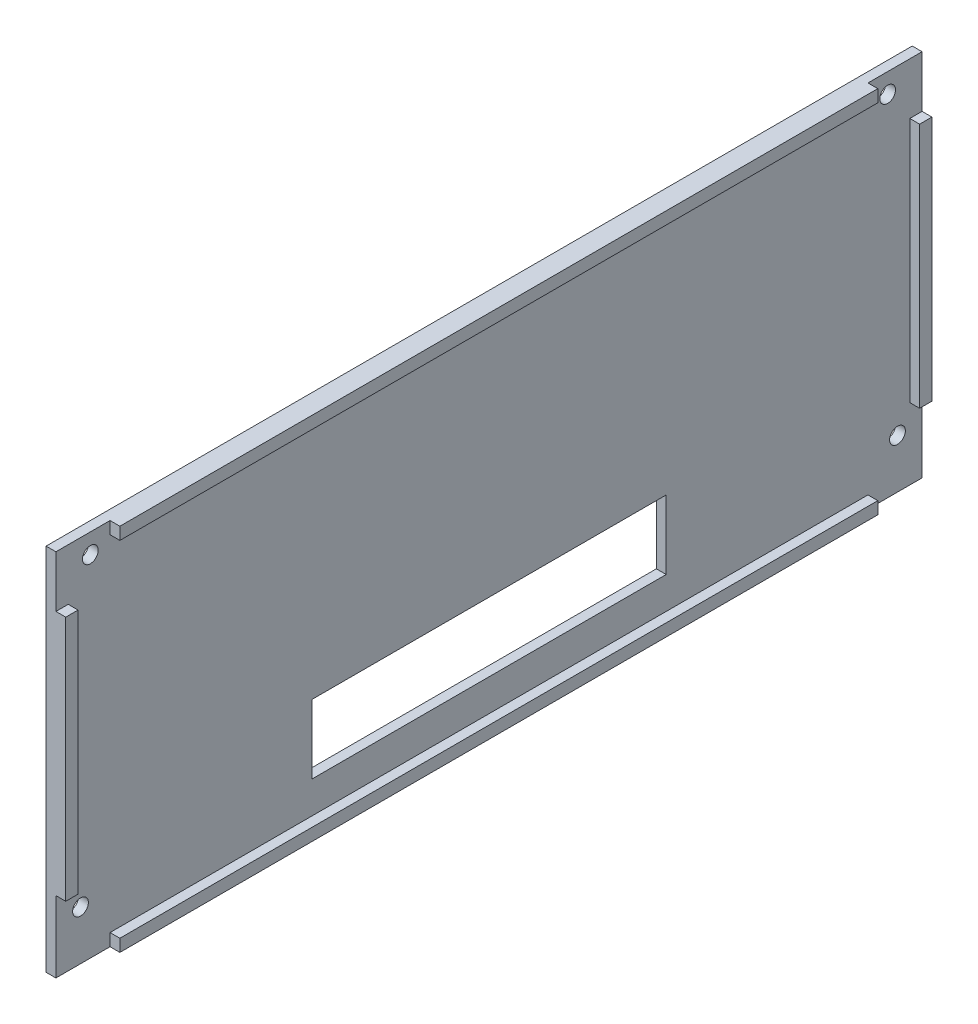
ISO-10303-21;
HEADER;
FILE_DESCRIPTION(('STEP AP214'),'2;1');
FILE_NAME('part.step','',(''),(''),'','','');
FILE_SCHEMA(('AUTOMOTIVE_DESIGN { 1 0 10303 214 1 1 1 1 }'));
ENDSEC;
DATA;
#1=APPLICATION_CONTEXT('core data for automotive mechanical design processes');
#2=APPLICATION_PROTOCOL_DEFINITION('international standard','automotive_design',2000,#1);
#3=PRODUCT_CONTEXT('',#1,'mechanical');
#4=PRODUCT('Part','Part','',(#3));
#5=PRODUCT_RELATED_PRODUCT_CATEGORY('part','',(#4));
#6=PRODUCT_DEFINITION_FORMATION('','',#4);
#7=PRODUCT_DEFINITION_CONTEXT('part definition',#1,'design');
#8=PRODUCT_DEFINITION('design','',#6,#7);
#9=PRODUCT_DEFINITION_SHAPE('','',#8);
#10=(LENGTH_UNIT() NAMED_UNIT(*) SI_UNIT(.MILLI.,.METRE.));
#11=(NAMED_UNIT(*) PLANE_ANGLE_UNIT() SI_UNIT($,.RADIAN.));
#12=(NAMED_UNIT(*) SI_UNIT($,.STERADIAN.) SOLID_ANGLE_UNIT());
#13=UNCERTAINTY_MEASURE_WITH_UNIT(LENGTH_MEASURE(1.E-05),#10,'distance_accuracy_value','');
#14=(GEOMETRIC_REPRESENTATION_CONTEXT(3) GLOBAL_UNCERTAINTY_ASSIGNED_CONTEXT((#13)) GLOBAL_UNIT_ASSIGNED_CONTEXT((#10,
#11,#12)) REPRESENTATION_CONTEXT('',''));
#15=CARTESIAN_POINT('',(0.,0.,0.));
#16=DIRECTION('',(0.,0.,1.));
#17=DIRECTION('',(1.,0.,0.));
#18=AXIS2_PLACEMENT_3D('',#15,#16,#17);
#19=CARTESIAN_POINT('',(2.,0.,0.));
#20=DIRECTION('',(1.,0.,0.));
#21=DIRECTION('',(0.,0.,-1.));
#22=AXIS2_PLACEMENT_3D('',#19,#20,#21);
#23=PLANE('',#22);
#24=DIRECTION('',(0.,-1.,0.));
#25=VECTOR('',#24,1.);
#26=CARTESIAN_POINT('',(2.,-28.5,36.));
#27=LINE('',#26,#25);
#28=CARTESIAN_POINT('',(2.,-14.5,36.));
#29=VERTEX_POINT('',#28);
#30=CARTESIAN_POINT('',(2.,-28.5,36.));
#31=VERTEX_POINT('',#30);
#32=EDGE_CURVE('E311',#29,#31,#27,.T.);
#33=ORIENTED_EDGE('',*,*,#32,.F.);
#34=DIRECTION('',(0.,0.,1.));
#35=VECTOR('',#34,1.);
#36=CARTESIAN_POINT('',(2.,-14.5,36.));
#37=LINE('',#36,#35);
#38=CARTESIAN_POINT('',(2.,-14.5,-36.));
#39=VERTEX_POINT('',#38);
#40=EDGE_CURVE('E316',#39,#29,#37,.T.);
#41=ORIENTED_EDGE('',*,*,#40,.F.);
#42=DIRECTION('',(0.,1.,0.));
#43=VECTOR('',#42,1.);
#44=CARTESIAN_POINT('',(2.,-28.5,-36.));
#45=LINE('',#44,#43);
#46=CARTESIAN_POINT('',(2.,-28.5,-36.));
#47=VERTEX_POINT('',#46);
#48=EDGE_CURVE('E330',#47,#39,#45,.T.);
#49=ORIENTED_EDGE('',*,*,#48,.F.);
#50=DIRECTION('',(0.,0.,-1.));
#51=VECTOR('',#50,1.);
#52=CARTESIAN_POINT('',(2.,-28.5,36.));
#53=LINE('',#52,#51);
#54=EDGE_CURVE('E327',#31,#47,#53,.T.);
#55=ORIENTED_EDGE('',*,*,#54,.F.);
#56=EDGE_LOOP('',(#33,#41,#49,#55));
#57=FACE_BOUND('',#56,.T.);
#58=CARTESIAN_POINT('',(2.,-27.5,83.));
#59=DIRECTION('',(1.,0.,0.));
#60=DIRECTION('',(0.,0.,-1.));
#61=AXIS2_PLACEMENT_3D('',#58,#59,#60);
#62=CIRCLE('',#61,1.6);
#63=CARTESIAN_POINT('',(2.,-27.5,81.4));
#64=VERTEX_POINT('',#63);
#65=EDGE_CURVE('E350',#64,#64,#62,.T.);
#66=ORIENTED_EDGE('',*,*,#65,.F.);
#67=EDGE_LOOP('',(#66));
#68=FACE_BOUND('',#67,.T.);
#69=CARTESIAN_POINT('',(2.,33.5,81.));
#70=DIRECTION('',(1.,0.,0.));
#71=DIRECTION('',(0.,0.,-1.));
#72=AXIS2_PLACEMENT_3D('',#69,#70,#71);
#73=CIRCLE('',#72,1.60000000000001);
#74=CARTESIAN_POINT('',(2.,33.5,79.4));
#75=VERTEX_POINT('',#74);
#76=EDGE_CURVE('E362',#75,#75,#73,.T.);
#77=ORIENTED_EDGE('',*,*,#76,.F.);
#78=EDGE_LOOP('',(#77));
#79=FACE_BOUND('',#78,.T.);
#80=CARTESIAN_POINT('',(2.,33.5,-81.));
#81=DIRECTION('',(1.,0.,0.));
#82=DIRECTION('',(0.,0.,1.));
#83=AXIS2_PLACEMENT_3D('',#80,#81,#82);
#84=CIRCLE('',#83,1.60000000000001);
#85=CARTESIAN_POINT('',(2.,33.5,-79.4));
#86=VERTEX_POINT('',#85);
#87=EDGE_CURVE('E356',#86,#86,#84,.T.);
#88=ORIENTED_EDGE('',*,*,#87,.F.);
#89=EDGE_LOOP('',(#88));
#90=FACE_BOUND('',#89,.T.);
#91=CARTESIAN_POINT('',(2.,-27.5,-82.9999999999999));
#92=DIRECTION('',(1.,0.,0.));
#93=DIRECTION('',(0.,0.,1.));
#94=AXIS2_PLACEMENT_3D('',#91,#92,#93);
#95=CIRCLE('',#94,1.6);
#96=CARTESIAN_POINT('',(2.,-27.5,-81.3999999999999));
#97=VERTEX_POINT('',#96);
#98=EDGE_CURVE('E344',#97,#97,#95,.T.);
#99=ORIENTED_EDGE('',*,*,#98,.F.);
#100=EDGE_LOOP('',(#99));
#101=FACE_BOUND('',#100,.T.);
#102=DIRECTION('',(0.,-1.,0.));
#103=VECTOR('',#102,1.);
#104=CARTESIAN_POINT('',(2.,27.,-85.5));
#105=LINE('',#104,#103);
#106=CARTESIAN_POINT('',(2.,27.,-85.5));
#107=VERTEX_POINT('',#106);
#108=CARTESIAN_POINT('',(2.,-23.,-85.5));
#109=VERTEX_POINT('',#108);
#110=EDGE_CURVE('E48',#107,#109,#105,.T.);
#111=ORIENTED_EDGE('',*,*,#110,.F.);
#112=DIRECTION('',(0.,0.,1.));
#113=VECTOR('',#112,1.);
#114=CARTESIAN_POINT('',(2.,27.,-88.));
#115=LINE('',#114,#113);
#116=CARTESIAN_POINT('',(2.,27.,-88.));
#117=VERTEX_POINT('',#116);
#118=EDGE_CURVE('E416',#117,#107,#115,.T.);
#119=ORIENTED_EDGE('',*,*,#118,.F.);
#120=DIRECTION('',(0.,1.,0.));
#121=VECTOR('',#120,1.);
#122=CARTESIAN_POINT('',(2.,37.5,-88.));
#123=LINE('',#122,#121);
#124=CARTESIAN_POINT('',(2.,37.5,-88.));
#125=VERTEX_POINT('',#124);
#126=EDGE_CURVE('E215',#117,#125,#123,.T.);
#127=ORIENTED_EDGE('',*,*,#126,.T.);
#128=DIRECTION('',(0.,0.,1.));
#129=VECTOR('',#128,1.);
#130=CARTESIAN_POINT('',(2.,37.5,88.));
#131=LINE('',#130,#129);
#132=CARTESIAN_POINT('',(2.,37.5,-77.));
#133=VERTEX_POINT('',#132);
#134=EDGE_CURVE('E371',#125,#133,#131,.T.);
#135=ORIENTED_EDGE('',*,*,#134,.T.);
#136=DIRECTION('',(0.,1.,0.));
#137=VECTOR('',#136,1.);
#138=CARTESIAN_POINT('',(2.,37.5,-77.));
#139=LINE('',#138,#137);
#140=CARTESIAN_POINT('',(2.,34.9999999999999,-77.));
#141=VERTEX_POINT('',#140);
#142=EDGE_CURVE('E256',#141,#133,#139,.T.);
#143=ORIENTED_EDGE('',*,*,#142,.F.);
#144=DIRECTION('',(0.,0.,-1.));
#145=VECTOR('',#144,1.);
#146=CARTESIAN_POINT('',(2.,35.,77.));
#147=LINE('',#146,#145);
#148=CARTESIAN_POINT('',(2.,35.,77.));
#149=VERTEX_POINT('',#148);
#150=EDGE_CURVE('E265',#149,#141,#147,.T.);
#151=ORIENTED_EDGE('',*,*,#150,.F.);
#152=DIRECTION('',(0.,-1.,0.));
#153=VECTOR('',#152,1.);
#154=CARTESIAN_POINT('',(2.,37.5,77.));
#155=LINE('',#154,#153);
#156=CARTESIAN_POINT('',(2.,37.5,77.));
#157=VERTEX_POINT('',#156);
#158=EDGE_CURVE('E251',#157,#149,#155,.T.);
#159=ORIENTED_EDGE('',*,*,#158,.F.);
#160=CARTESIAN_POINT('',(2.,37.5,88.));
#161=VERTEX_POINT('',#160);
#162=EDGE_CURVE('E370',#157,#161,#131,.T.);
#163=ORIENTED_EDGE('',*,*,#162,.T.);
#164=DIRECTION('',(0.,-1.,0.));
#165=VECTOR('',#164,1.);
#166=CARTESIAN_POINT('',(2.,37.5,88.));
#167=LINE('',#166,#165);
#168=CARTESIAN_POINT('',(2.,27.,88.));
#169=VERTEX_POINT('',#168);
#170=EDGE_CURVE('E374',#161,#169,#167,.T.);
#171=ORIENTED_EDGE('',*,*,#170,.T.);
#172=DIRECTION('',(0.,0.,1.));
#173=VECTOR('',#172,1.);
#174=CARTESIAN_POINT('',(2.,27.,88.));
#175=LINE('',#174,#173);
#176=CARTESIAN_POINT('',(2.,27.,85.5));
#177=VERTEX_POINT('',#176);
#178=EDGE_CURVE('E229',#177,#169,#175,.T.);
#179=ORIENTED_EDGE('',*,*,#178,.F.);
#180=DIRECTION('',(0.,1.,0.));
#181=VECTOR('',#180,1.);
#182=CARTESIAN_POINT('',(2.,27.,85.5));
#183=LINE('',#182,#181);
#184=CARTESIAN_POINT('',(2.,-23.,85.5));
#185=VERTEX_POINT('',#184);
#186=EDGE_CURVE('E219',#185,#177,#183,.T.);
#187=ORIENTED_EDGE('',*,*,#186,.F.);
#188=DIRECTION('',(0.,0.,-1.));
#189=VECTOR('',#188,1.);
#190=CARTESIAN_POINT('',(2.,-23.,88.));
#191=LINE('',#190,#189);
#192=CARTESIAN_POINT('',(2.,-23.,88.));
#193=VERTEX_POINT('',#192);
#194=EDGE_CURVE('E216',#193,#185,#191,.T.);
#195=ORIENTED_EDGE('',*,*,#194,.F.);
#196=CARTESIAN_POINT('',(2.,-37.5,88.));
#197=VERTEX_POINT('',#196);
#198=EDGE_CURVE('E373',#193,#197,#167,.T.);
#199=ORIENTED_EDGE('',*,*,#198,.T.);
#200=DIRECTION('',(0.,0.,-1.));
#201=VECTOR('',#200,1.);
#202=CARTESIAN_POINT('',(2.,-37.5,88.));
#203=LINE('',#202,#201);
#204=CARTESIAN_POINT('',(2.,-37.5,77.));
#205=VERTEX_POINT('',#204);
#206=EDGE_CURVE('E377',#197,#205,#203,.T.);
#207=ORIENTED_EDGE('',*,*,#206,.T.);
#208=DIRECTION('',(0.,-1.,0.));
#209=VECTOR('',#208,1.);
#210=CARTESIAN_POINT('',(2.,-37.5,77.));
#211=LINE('',#210,#209);
#212=CARTESIAN_POINT('',(2.,-35.,77.));
#213=VERTEX_POINT('',#212);
#214=EDGE_CURVE('E281',#213,#205,#211,.T.);
#215=ORIENTED_EDGE('',*,*,#214,.F.);
#216=DIRECTION('',(0.,0.,1.));
#217=VECTOR('',#216,1.);
#218=CARTESIAN_POINT('',(2.,-35.,77.));
#219=LINE('',#218,#217);
#220=CARTESIAN_POINT('',(2.,-34.9999999999999,-77.));
#221=VERTEX_POINT('',#220);
#222=EDGE_CURVE('E286',#221,#213,#219,.T.);
#223=ORIENTED_EDGE('',*,*,#222,.F.);
#224=DIRECTION('',(0.,1.,0.));
#225=VECTOR('',#224,1.);
#226=CARTESIAN_POINT('',(2.,-37.5,-77.));
#227=LINE('',#226,#225);
#228=CARTESIAN_POINT('',(2.,-37.5,-77.));
#229=VERTEX_POINT('',#228);
#230=EDGE_CURVE('E295',#229,#221,#227,.T.);
#231=ORIENTED_EDGE('',*,*,#230,.F.);
#232=CARTESIAN_POINT('',(2.,-37.5,-88.));
#233=VERTEX_POINT('',#232);
#234=EDGE_CURVE('E376',#229,#233,#203,.T.);
#235=ORIENTED_EDGE('',*,*,#234,.T.);
#236=CARTESIAN_POINT('',(2.,-23.,-88.));
#237=VERTEX_POINT('',#236);
#238=EDGE_CURVE('E368',#233,#237,#123,.T.);
#239=ORIENTED_EDGE('',*,*,#238,.T.);
#240=DIRECTION('',(0.,0.,-1.));
#241=VECTOR('',#240,1.);
#242=CARTESIAN_POINT('',(2.,-23.,-88.));
#243=LINE('',#242,#241);
#244=EDGE_CURVE('E53',#109,#237,#243,.T.);
#245=ORIENTED_EDGE('',*,*,#244,.F.);
#246=EDGE_LOOP('',(#111,#119,#127,#135,#143,#151,#159,#163,#171,#179,#187,#195,#199,#207,#215,
#223,#231,#235,#239,#245));
#247=FACE_BOUND('',#246,.T.);
#248=ADVANCED_FACE('F33',(#57,#68,#79,#90,#101,#247),#23,.T.);
#249=CARTESIAN_POINT('',(0.,0.,0.));
#250=DIRECTION('',(1.,0.,0.));
#251=DIRECTION('',(0.,0.,-1.));
#252=AXIS2_PLACEMENT_3D('',#249,#250,#251);
#253=PLANE('',#252);
#254=DIRECTION('',(0.,0.,1.));
#255=VECTOR('',#254,1.);
#256=CARTESIAN_POINT('',(0.,-14.5,36.));
#257=LINE('',#256,#255);
#258=CARTESIAN_POINT('',(0.,-14.5,-36.));
#259=VERTEX_POINT('',#258);
#260=CARTESIAN_POINT('',(0.,-14.5,36.));
#261=VERTEX_POINT('',#260);
#262=EDGE_CURVE('E322',#259,#261,#257,.T.);
#263=ORIENTED_EDGE('',*,*,#262,.T.);
#264=DIRECTION('',(0.,-1.,0.));
#265=VECTOR('',#264,1.);
#266=CARTESIAN_POINT('',(0.,-28.5,36.));
#267=LINE('',#266,#265);
#268=CARTESIAN_POINT('',(0.,-28.5,36.));
#269=VERTEX_POINT('',#268);
#270=EDGE_CURVE('E312',#261,#269,#267,.T.);
#271=ORIENTED_EDGE('',*,*,#270,.T.);
#272=DIRECTION('',(0.,0.,-1.));
#273=VECTOR('',#272,1.);
#274=CARTESIAN_POINT('',(0.,-28.5,36.));
#275=LINE('',#274,#273);
#276=CARTESIAN_POINT('',(0.,-28.5,-36.));
#277=VERTEX_POINT('',#276);
#278=EDGE_CURVE('E315',#269,#277,#275,.T.);
#279=ORIENTED_EDGE('',*,*,#278,.T.);
#280=DIRECTION('',(0.,1.,0.));
#281=VECTOR('',#280,1.);
#282=CARTESIAN_POINT('',(0.,-28.5,-36.));
#283=LINE('',#282,#281);
#284=EDGE_CURVE('E319',#277,#259,#283,.T.);
#285=ORIENTED_EDGE('',*,*,#284,.T.);
#286=EDGE_LOOP('',(#263,#271,#279,#285));
#287=FACE_BOUND('',#286,.T.);
#288=DIRECTION('',(0.,1.,0.));
#289=VECTOR('',#288,1.);
#290=CARTESIAN_POINT('',(0.,37.5,-88.));
#291=LINE('',#290,#289);
#292=CARTESIAN_POINT('',(0.,-37.5,-88.));
#293=VERTEX_POINT('',#292);
#294=CARTESIAN_POINT('',(0.,37.5,-88.));
#295=VERTEX_POINT('',#294);
#296=EDGE_CURVE('E365',#293,#295,#291,.T.);
#297=ORIENTED_EDGE('',*,*,#296,.F.);
#298=DIRECTION('',(0.,0.,-1.));
#299=VECTOR('',#298,1.);
#300=CARTESIAN_POINT('',(0.,-37.5,88.));
#301=LINE('',#300,#299);
#302=CARTESIAN_POINT('',(0.,-37.5,88.));
#303=VERTEX_POINT('',#302);
#304=EDGE_CURVE('E385',#303,#293,#301,.T.);
#305=ORIENTED_EDGE('',*,*,#304,.F.);
#306=DIRECTION('',(0.,-1.,0.));
#307=VECTOR('',#306,1.);
#308=CARTESIAN_POINT('',(0.,37.5,88.));
#309=LINE('',#308,#307);
#310=CARTESIAN_POINT('',(0.,37.5,88.));
#311=VERTEX_POINT('',#310);
#312=EDGE_CURVE('E383',#311,#303,#309,.T.);
#313=ORIENTED_EDGE('',*,*,#312,.F.);
#314=DIRECTION('',(0.,0.,1.));
#315=VECTOR('',#314,1.);
#316=CARTESIAN_POINT('',(0.,37.5,88.));
#317=LINE('',#316,#315);
#318=EDGE_CURVE('E381',#295,#311,#317,.T.);
#319=ORIENTED_EDGE('',*,*,#318,.F.);
#320=EDGE_LOOP('',(#297,#305,#313,#319));
#321=FACE_BOUND('',#320,.T.);
#322=CARTESIAN_POINT('',(0.,33.5,81.));
#323=DIRECTION('',(1.,0.,0.));
#324=DIRECTION('',(0.,0.,-1.));
#325=AXIS2_PLACEMENT_3D('',#322,#323,#324);
#326=CIRCLE('',#325,1.60000000000001);
#327=CARTESIAN_POINT('',(0.,33.5,79.4));
#328=VERTEX_POINT('',#327);
#329=EDGE_CURVE('E359',#328,#328,#326,.T.);
#330=ORIENTED_EDGE('',*,*,#329,.T.);
#331=EDGE_LOOP('',(#330));
#332=FACE_BOUND('',#331,.T.);
#333=CARTESIAN_POINT('',(0.,33.5,-81.));
#334=DIRECTION('',(1.,0.,0.));
#335=DIRECTION('',(0.,0.,1.));
#336=AXIS2_PLACEMENT_3D('',#333,#334,#335);
#337=CIRCLE('',#336,1.60000000000001);
#338=CARTESIAN_POINT('',(0.,33.5,-79.4));
#339=VERTEX_POINT('',#338);
#340=EDGE_CURVE('E353',#339,#339,#337,.T.);
#341=ORIENTED_EDGE('',*,*,#340,.T.);
#342=EDGE_LOOP('',(#341));
#343=FACE_BOUND('',#342,.T.);
#344=CARTESIAN_POINT('',(0.,-27.5,83.));
#345=DIRECTION('',(1.,0.,0.));
#346=DIRECTION('',(0.,0.,-1.));
#347=AXIS2_PLACEMENT_3D('',#344,#345,#346);
#348=CIRCLE('',#347,1.6);
#349=CARTESIAN_POINT('',(0.,-27.5,81.4));
#350=VERTEX_POINT('',#349);
#351=EDGE_CURVE('E347',#350,#350,#348,.T.);
#352=ORIENTED_EDGE('',*,*,#351,.T.);
#353=EDGE_LOOP('',(#352));
#354=FACE_BOUND('',#353,.T.);
#355=CARTESIAN_POINT('',(0.,-27.5,-82.9999999999999));
#356=DIRECTION('',(1.,0.,0.));
#357=DIRECTION('',(0.,0.,1.));
#358=AXIS2_PLACEMENT_3D('',#355,#356,#357);
#359=CIRCLE('',#358,1.6);
#360=CARTESIAN_POINT('',(0.,-27.5,-81.3999999999999));
#361=VERTEX_POINT('',#360);
#362=EDGE_CURVE('E337',#361,#361,#359,.T.);
#363=ORIENTED_EDGE('',*,*,#362,.T.);
#364=EDGE_LOOP('',(#363));
#365=FACE_BOUND('',#364,.T.);
#366=ADVANCED_FACE('F402',(#287,#321,#332,#343,#354,#365),#253,.F.);
#367=CARTESIAN_POINT('',(2.,37.5,-88.));
#368=DIRECTION('',(0.,0.,1.));
#369=DIRECTION('',(1.,0.,0.));
#370=AXIS2_PLACEMENT_3D('',#367,#368,#369);
#371=PLANE('',#370);
#372=ORIENTED_EDGE('',*,*,#296,.T.);
#373=DIRECTION('',(-1.,0.,0.));
#374=VECTOR('',#373,1.);
#375=CARTESIAN_POINT('',(2.,37.5,-88.));
#376=LINE('',#375,#374);
#377=EDGE_CURVE('E11',#125,#295,#376,.T.);
#378=ORIENTED_EDGE('',*,*,#377,.F.);
#379=ORIENTED_EDGE('',*,*,#126,.F.);
#380=DIRECTION('',(-1.,0.,0.));
#381=VECTOR('',#380,1.);
#382=CARTESIAN_POINT('',(4.,27.,-88.));
#383=LINE('',#382,#381);
#384=CARTESIAN_POINT('',(4.,27.,-88.));
#385=VERTEX_POINT('',#384);
#386=EDGE_CURVE('E197',#385,#117,#383,.T.);
#387=ORIENTED_EDGE('',*,*,#386,.F.);
#388=DIRECTION('',(0.,1.,0.));
#389=VECTOR('',#388,1.);
#390=CARTESIAN_POINT('',(4.,27.,-88.));
#391=LINE('',#390,#389);
#392=CARTESIAN_POINT('',(4.,-23.,-88.));
#393=VERTEX_POINT('',#392);
#394=EDGE_CURVE('E203',#393,#385,#391,.T.);
#395=ORIENTED_EDGE('',*,*,#394,.F.);
#396=DIRECTION('',(-1.,0.,0.));
#397=VECTOR('',#396,1.);
#398=CARTESIAN_POINT('',(4.,-23.,-88.));
#399=LINE('',#398,#397);
#400=EDGE_CURVE('E410',#393,#237,#399,.T.);
#401=ORIENTED_EDGE('',*,*,#400,.T.);
#402=ORIENTED_EDGE('',*,*,#238,.F.);
#403=DIRECTION('',(-1.,0.,0.));
#404=VECTOR('',#403,1.);
#405=CARTESIAN_POINT('',(2.,-37.5,-88.));
#406=LINE('',#405,#404);
#407=EDGE_CURVE('E379',#233,#293,#406,.T.);
#408=ORIENTED_EDGE('',*,*,#407,.T.);
#409=EDGE_LOOP('',(#372,#378,#379,#387,#395,#401,#402,#408));
#410=FACE_BOUND('',#409,.T.);
#411=ADVANCED_FACE('F35',(#410),#371,.F.);
#412=CARTESIAN_POINT('',(2.,37.5,88.));
#413=DIRECTION('',(0.,-1.,0.));
#414=DIRECTION('',(0.,0.,-1.));
#415=AXIS2_PLACEMENT_3D('',#412,#413,#414);
#416=PLANE('',#415);
#417=ORIENTED_EDGE('',*,*,#318,.T.);
#418=DIRECTION('',(-1.,0.,0.));
#419=VECTOR('',#418,1.);
#420=CARTESIAN_POINT('',(2.,37.5,88.));
#421=LINE('',#420,#419);
#422=EDGE_CURVE('E41',#161,#311,#421,.T.);
#423=ORIENTED_EDGE('',*,*,#422,.F.);
#424=ORIENTED_EDGE('',*,*,#162,.F.);
#425=DIRECTION('',(-1.,0.,0.));
#426=VECTOR('',#425,1.);
#427=CARTESIAN_POINT('',(4.,37.5,77.));
#428=LINE('',#427,#426);
#429=CARTESIAN_POINT('',(4.,37.5,77.));
#430=VERTEX_POINT('',#429);
#431=EDGE_CURVE('E262',#430,#157,#428,.T.);
#432=ORIENTED_EDGE('',*,*,#431,.F.);
#433=DIRECTION('',(0.,0.,1.));
#434=VECTOR('',#433,1.);
#435=CARTESIAN_POINT('',(4.,37.5,77.));
#436=LINE('',#435,#434);
#437=CARTESIAN_POINT('',(4.,37.5,-77.));
#438=VERTEX_POINT('',#437);
#439=EDGE_CURVE('E260',#438,#430,#436,.T.);
#440=ORIENTED_EDGE('',*,*,#439,.F.);
#441=DIRECTION('',(-1.,0.,0.));
#442=VECTOR('',#441,1.);
#443=CARTESIAN_POINT('',(4.,37.5,-77.));
#444=LINE('',#443,#442);
#445=EDGE_CURVE('E272',#438,#133,#444,.T.);
#446=ORIENTED_EDGE('',*,*,#445,.T.);
#447=ORIENTED_EDGE('',*,*,#134,.F.);
#448=ORIENTED_EDGE('',*,*,#377,.T.);
#449=EDGE_LOOP('',(#417,#423,#424,#432,#440,#446,#447,#448));
#450=FACE_BOUND('',#449,.T.);
#451=ADVANCED_FACE('F450',(#450),#416,.F.);
#452=CARTESIAN_POINT('',(2.,37.5,88.));
#453=DIRECTION('',(0.,0.,-1.));
#454=DIRECTION('',(0.,1.,0.));
#455=AXIS2_PLACEMENT_3D('',#452,#453,#454);
#456=PLANE('',#455);
#457=ORIENTED_EDGE('',*,*,#312,.T.);
#458=DIRECTION('',(-1.,0.,0.));
#459=VECTOR('',#458,1.);
#460=CARTESIAN_POINT('',(2.,-37.5,88.));
#461=LINE('',#460,#459);
#462=EDGE_CURVE('E389',#197,#303,#461,.T.);
#463=ORIENTED_EDGE('',*,*,#462,.F.);
#464=ORIENTED_EDGE('',*,*,#198,.F.);
#465=DIRECTION('',(-1.,0.,0.));
#466=VECTOR('',#465,1.);
#467=CARTESIAN_POINT('',(4.,-23.,88.));
#468=LINE('',#467,#466);
#469=CARTESIAN_POINT('',(4.,-23.,88.));
#470=VERTEX_POINT('',#469);
#471=EDGE_CURVE('E248',#470,#193,#468,.T.);
#472=ORIENTED_EDGE('',*,*,#471,.F.);
#473=DIRECTION('',(0.,-1.,0.));
#474=VECTOR('',#473,1.);
#475=CARTESIAN_POINT('',(4.,27.,88.));
#476=LINE('',#475,#474);
#477=CARTESIAN_POINT('',(4.,27.,88.));
#478=VERTEX_POINT('',#477);
#479=EDGE_CURVE('E225',#478,#470,#476,.T.);
#480=ORIENTED_EDGE('',*,*,#479,.F.);
#481=DIRECTION('',(-1.,0.,0.));
#482=VECTOR('',#481,1.);
#483=CARTESIAN_POINT('',(4.,27.,88.));
#484=LINE('',#483,#482);
#485=EDGE_CURVE('E234',#478,#169,#484,.T.);
#486=ORIENTED_EDGE('',*,*,#485,.T.);
#487=ORIENTED_EDGE('',*,*,#170,.F.);
#488=ORIENTED_EDGE('',*,*,#422,.T.);
#489=EDGE_LOOP('',(#457,#463,#464,#472,#480,#486,#487,#488));
#490=FACE_BOUND('',#489,.T.);
#491=ADVANCED_FACE('F396',(#490),#456,.F.);
#492=CARTESIAN_POINT('',(2.,-37.5,88.));
#493=DIRECTION('',(0.,1.,0.));
#494=DIRECTION('',(0.,0.,1.));
#495=AXIS2_PLACEMENT_3D('',#492,#493,#494);
#496=PLANE('',#495);
#497=ORIENTED_EDGE('',*,*,#304,.T.);
#498=ORIENTED_EDGE('',*,*,#407,.F.);
#499=ORIENTED_EDGE('',*,*,#234,.F.);
#500=DIRECTION('',(-1.,0.,0.));
#501=VECTOR('',#500,1.);
#502=CARTESIAN_POINT('',(4.,-37.5,-77.));
#503=LINE('',#502,#501);
#504=CARTESIAN_POINT('',(4.,-37.5,-77.));
#505=VERTEX_POINT('',#504);
#506=EDGE_CURVE('E305',#505,#229,#503,.T.);
#507=ORIENTED_EDGE('',*,*,#506,.F.);
#508=DIRECTION('',(0.,0.,-1.));
#509=VECTOR('',#508,1.);
#510=CARTESIAN_POINT('',(4.,-37.5,77.));
#511=LINE('',#510,#509);
#512=CARTESIAN_POINT('',(4.,-37.5,77.));
#513=VERTEX_POINT('',#512);
#514=EDGE_CURVE('E285',#513,#505,#511,.T.);
#515=ORIENTED_EDGE('',*,*,#514,.F.);
#516=DIRECTION('',(-1.,0.,0.));
#517=VECTOR('',#516,1.);
#518=CARTESIAN_POINT('',(4.,-37.5,77.));
#519=LINE('',#518,#517);
#520=EDGE_CURVE('E308',#513,#205,#519,.T.);
#521=ORIENTED_EDGE('',*,*,#520,.T.);
#522=ORIENTED_EDGE('',*,*,#206,.F.);
#523=ORIENTED_EDGE('',*,*,#462,.T.);
#524=EDGE_LOOP('',(#497,#498,#499,#507,#515,#521,#522,#523));
#525=FACE_BOUND('',#524,.T.);
#526=ADVANCED_FACE('F406',(#525),#496,.F.);
#527=CARTESIAN_POINT('',(2.,33.5,81.));
#528=DIRECTION('',(-1.,0.,0.));
#529=DIRECTION('',(0.,0.,1.));
#530=AXIS2_PLACEMENT_3D('',#527,#528,#529);
#531=CYLINDRICAL_SURFACE('',#530,1.60000000000001);
#532=ORIENTED_EDGE('',*,*,#76,.T.);
#533=EDGE_LOOP('',(#532));
#534=FACE_BOUND('',#533,.T.);
#535=ORIENTED_EDGE('',*,*,#329,.F.);
#536=EDGE_LOOP('',(#535));
#537=FACE_BOUND('',#536,.T.);
#538=ADVANCED_FACE('F444',(#534,#537),#531,.F.);
#539=CARTESIAN_POINT('',(2.,33.5,-81.));
#540=DIRECTION('',(-1.,0.,0.));
#541=DIRECTION('',(0.,0.,1.));
#542=AXIS2_PLACEMENT_3D('',#539,#540,#541);
#543=CYLINDRICAL_SURFACE('',#542,1.60000000000001);
#544=ORIENTED_EDGE('',*,*,#87,.T.);
#545=EDGE_LOOP('',(#544));
#546=FACE_BOUND('',#545,.T.);
#547=ORIENTED_EDGE('',*,*,#340,.F.);
#548=EDGE_LOOP('',(#547));
#549=FACE_BOUND('',#548,.T.);
#550=ADVANCED_FACE('F527',(#546,#549),#543,.F.);
#551=CARTESIAN_POINT('',(2.,-27.5,83.));
#552=DIRECTION('',(-1.,0.,0.));
#553=DIRECTION('',(0.,0.,1.));
#554=AXIS2_PLACEMENT_3D('',#551,#552,#553);
#555=CYLINDRICAL_SURFACE('',#554,1.6);
#556=ORIENTED_EDGE('',*,*,#65,.T.);
#557=EDGE_LOOP('',(#556));
#558=FACE_BOUND('',#557,.T.);
#559=ORIENTED_EDGE('',*,*,#351,.F.);
#560=EDGE_LOOP('',(#559));
#561=FACE_BOUND('',#560,.T.);
#562=ADVANCED_FACE('F524',(#558,#561),#555,.F.);
#563=CARTESIAN_POINT('',(2.,-27.5,-82.9999999999999));
#564=DIRECTION('',(-1.,0.,0.));
#565=DIRECTION('',(0.,0.,1.));
#566=AXIS2_PLACEMENT_3D('',#563,#564,#565);
#567=CYLINDRICAL_SURFACE('',#566,1.6);
#568=ORIENTED_EDGE('',*,*,#98,.T.);
#569=EDGE_LOOP('',(#568));
#570=FACE_BOUND('',#569,.T.);
#571=ORIENTED_EDGE('',*,*,#362,.F.);
#572=EDGE_LOOP('',(#571));
#573=FACE_BOUND('',#572,.T.);
#574=ADVANCED_FACE('F520',(#570,#573),#567,.F.);
#575=CARTESIAN_POINT('',(0.,-28.5,36.));
#576=DIRECTION('',(0.,0.,1.));
#577=DIRECTION('',(1.,0.,0.));
#578=AXIS2_PLACEMENT_3D('',#575,#576,#577);
#579=PLANE('',#578);
#580=ORIENTED_EDGE('',*,*,#32,.T.);
#581=DIRECTION('',(1.,0.,0.));
#582=VECTOR('',#581,1.);
#583=CARTESIAN_POINT('',(0.,-28.5,36.));
#584=LINE('',#583,#582);
#585=EDGE_CURVE('E325',#269,#31,#584,.T.);
#586=ORIENTED_EDGE('',*,*,#585,.F.);
#587=ORIENTED_EDGE('',*,*,#270,.F.);
#588=DIRECTION('',(1.,0.,0.));
#589=VECTOR('',#588,1.);
#590=CARTESIAN_POINT('',(0.,-14.5,36.));
#591=LINE('',#590,#589);
#592=EDGE_CURVE('E335',#261,#29,#591,.T.);
#593=ORIENTED_EDGE('',*,*,#592,.T.);
#594=EDGE_LOOP('',(#580,#586,#587,#593));
#595=FACE_BOUND('',#594,.T.);
#596=ADVANCED_FACE('F510',(#595),#579,.F.);
#597=CARTESIAN_POINT('',(0.,-14.5,36.));
#598=DIRECTION('',(0.,1.,0.));
#599=DIRECTION('',(0.,0.,1.));
#600=AXIS2_PLACEMENT_3D('',#597,#598,#599);
#601=PLANE('',#600);
#602=ORIENTED_EDGE('',*,*,#40,.T.);
#603=ORIENTED_EDGE('',*,*,#592,.F.);
#604=ORIENTED_EDGE('',*,*,#262,.F.);
#605=DIRECTION('',(1.,0.,0.));
#606=VECTOR('',#605,1.);
#607=CARTESIAN_POINT('',(0.,-14.5,-36.));
#608=LINE('',#607,#606);
#609=EDGE_CURVE('E338',#259,#39,#608,.T.);
#610=ORIENTED_EDGE('',*,*,#609,.T.);
#611=EDGE_LOOP('',(#602,#603,#604,#610));
#612=FACE_BOUND('',#611,.T.);
#613=ADVANCED_FACE('F506',(#612),#601,.F.);
#614=CARTESIAN_POINT('',(0.,-28.5,-36.));
#615=DIRECTION('',(0.,0.,-1.));
#616=DIRECTION('',(-1.,0.,0.));
#617=AXIS2_PLACEMENT_3D('',#614,#615,#616);
#618=PLANE('',#617);
#619=ORIENTED_EDGE('',*,*,#48,.T.);
#620=ORIENTED_EDGE('',*,*,#609,.F.);
#621=ORIENTED_EDGE('',*,*,#284,.F.);
#622=DIRECTION('',(1.,0.,0.));
#623=VECTOR('',#622,1.);
#624=CARTESIAN_POINT('',(0.,-28.5,-36.));
#625=LINE('',#624,#623);
#626=EDGE_CURVE('E340',#277,#47,#625,.T.);
#627=ORIENTED_EDGE('',*,*,#626,.T.);
#628=EDGE_LOOP('',(#619,#620,#621,#627));
#629=FACE_BOUND('',#628,.T.);
#630=ADVANCED_FACE('F509',(#629),#618,.F.);
#631=CARTESIAN_POINT('',(0.,-28.5,36.));
#632=DIRECTION('',(0.,-1.,0.));
#633=DIRECTION('',(0.,0.,-1.));
#634=AXIS2_PLACEMENT_3D('',#631,#632,#633);
#635=PLANE('',#634);
#636=ORIENTED_EDGE('',*,*,#54,.T.);
#637=ORIENTED_EDGE('',*,*,#626,.F.);
#638=ORIENTED_EDGE('',*,*,#278,.F.);
#639=ORIENTED_EDGE('',*,*,#585,.T.);
#640=EDGE_LOOP('',(#636,#637,#638,#639));
#641=FACE_BOUND('',#640,.T.);
#642=ADVANCED_FACE('F504',(#641),#635,.F.);
#643=CARTESIAN_POINT('',(4.,-37.5,77.));
#644=DIRECTION('',(0.,0.,-1.));
#645=DIRECTION('',(-1.,0.,0.));
#646=AXIS2_PLACEMENT_3D('',#643,#644,#645);
#647=PLANE('',#646);
#648=ORIENTED_EDGE('',*,*,#214,.T.);
#649=ORIENTED_EDGE('',*,*,#520,.F.);
#650=DIRECTION('',(0.,-1.,0.));
#651=VECTOR('',#650,1.);
#652=CARTESIAN_POINT('',(4.,-37.5,77.));
#653=LINE('',#652,#651);
#654=CARTESIAN_POINT('',(4.,-35.,77.));
#655=VERTEX_POINT('',#654);
#656=EDGE_CURVE('E282',#655,#513,#653,.T.);
#657=ORIENTED_EDGE('',*,*,#656,.F.);
#658=DIRECTION('',(-1.,0.,0.));
#659=VECTOR('',#658,1.);
#660=CARTESIAN_POINT('',(4.,-35.,77.));
#661=LINE('',#660,#659);
#662=EDGE_CURVE('E292',#655,#213,#661,.T.);
#663=ORIENTED_EDGE('',*,*,#662,.T.);
#664=EDGE_LOOP('',(#648,#649,#657,#663));
#665=FACE_BOUND('',#664,.T.);
#666=ADVANCED_FACE('F500',(#665),#647,.F.);
#667=CARTESIAN_POINT('',(4.,-37.5,-77.));
#668=DIRECTION('',(0.,0.,1.));
#669=DIRECTION('',(1.,0.,0.));
#670=AXIS2_PLACEMENT_3D('',#667,#668,#669);
#671=PLANE('',#670);
#672=ORIENTED_EDGE('',*,*,#230,.T.);
#673=DIRECTION('',(-1.,0.,0.));
#674=VECTOR('',#673,1.);
#675=CARTESIAN_POINT('',(4.,-34.9999999999999,-77.));
#676=LINE('',#675,#674);
#677=CARTESIAN_POINT('',(4.,-34.9999999999999,-77.));
#678=VERTEX_POINT('',#677);
#679=EDGE_CURVE('E302',#678,#221,#676,.T.);
#680=ORIENTED_EDGE('',*,*,#679,.F.);
#681=DIRECTION('',(0.,1.,0.));
#682=VECTOR('',#681,1.);
#683=CARTESIAN_POINT('',(4.,-37.5,-77.));
#684=LINE('',#683,#682);
#685=EDGE_CURVE('E288',#505,#678,#684,.T.);
#686=ORIENTED_EDGE('',*,*,#685,.F.);
#687=ORIENTED_EDGE('',*,*,#506,.T.);
#688=EDGE_LOOP('',(#672,#680,#686,#687));
#689=FACE_BOUND('',#688,.T.);
#690=ADVANCED_FACE('F496',(#689),#671,.F.);
#691=CARTESIAN_POINT('',(4.,-35.,77.));
#692=DIRECTION('',(0.,-1.,0.));
#693=DIRECTION('',(0.,0.,-1.));
#694=AXIS2_PLACEMENT_3D('',#691,#692,#693);
#695=PLANE('',#694);
#696=ORIENTED_EDGE('',*,*,#222,.T.);
#697=ORIENTED_EDGE('',*,*,#662,.F.);
#698=DIRECTION('',(0.,0.,1.));
#699=VECTOR('',#698,1.);
#700=CARTESIAN_POINT('',(4.,-35.,77.));
#701=LINE('',#700,#699);
#702=EDGE_CURVE('E290',#678,#655,#701,.T.);
#703=ORIENTED_EDGE('',*,*,#702,.F.);
#704=ORIENTED_EDGE('',*,*,#679,.T.);
#705=EDGE_LOOP('',(#696,#697,#703,#704));
#706=FACE_BOUND('',#705,.T.);
#707=ADVANCED_FACE('F492',(#706),#695,.F.);
#708=CARTESIAN_POINT('',(4.,0.,0.));
#709=DIRECTION('',(-1.,0.,0.));
#710=DIRECTION('',(0.,0.,1.));
#711=AXIS2_PLACEMENT_3D('',#708,#709,#710);
#712=PLANE('',#711);
#713=ORIENTED_EDGE('',*,*,#656,.T.);
#714=ORIENTED_EDGE('',*,*,#514,.T.);
#715=ORIENTED_EDGE('',*,*,#685,.T.);
#716=ORIENTED_EDGE('',*,*,#702,.T.);
#717=EDGE_LOOP('',(#713,#714,#715,#716));
#718=FACE_BOUND('',#717,.T.);
#719=ADVANCED_FACE('F489',(#718),#712,.F.);
#720=CARTESIAN_POINT('',(4.,37.5,77.));
#721=DIRECTION('',(0.,0.,-1.));
#722=DIRECTION('',(-1.,0.,0.));
#723=AXIS2_PLACEMENT_3D('',#720,#721,#722);
#724=PLANE('',#723);
#725=ORIENTED_EDGE('',*,*,#158,.T.);
#726=DIRECTION('',(-1.,0.,0.));
#727=VECTOR('',#726,1.);
#728=CARTESIAN_POINT('',(4.,35.,77.));
#729=LINE('',#728,#727);
#730=CARTESIAN_POINT('',(4.,35.,77.));
#731=VERTEX_POINT('',#730);
#732=EDGE_CURVE('E278',#731,#149,#729,.T.);
#733=ORIENTED_EDGE('',*,*,#732,.F.);
#734=DIRECTION('',(0.,-1.,0.));
#735=VECTOR('',#734,1.);
#736=CARTESIAN_POINT('',(4.,37.5,77.));
#737=LINE('',#736,#735);
#738=EDGE_CURVE('E252',#430,#731,#737,.T.);
#739=ORIENTED_EDGE('',*,*,#738,.F.);
#740=ORIENTED_EDGE('',*,*,#431,.T.);
#741=EDGE_LOOP('',(#725,#733,#739,#740));
#742=FACE_BOUND('',#741,.T.);
#743=ADVANCED_FACE('F469',(#742),#724,.F.);
#744=CARTESIAN_POINT('',(4.,35.,77.));
#745=DIRECTION('',(0.,1.,0.));
#746=DIRECTION('',(0.,0.,1.));
#747=AXIS2_PLACEMENT_3D('',#744,#745,#746);
#748=PLANE('',#747);
#749=ORIENTED_EDGE('',*,*,#150,.T.);
#750=DIRECTION('',(-1.,0.,0.));
#751=VECTOR('',#750,1.);
#752=CARTESIAN_POINT('',(4.,34.9999999999999,-77.));
#753=LINE('',#752,#751);
#754=CARTESIAN_POINT('',(4.,34.9999999999999,-77.));
#755=VERTEX_POINT('',#754);
#756=EDGE_CURVE('E275',#755,#141,#753,.T.);
#757=ORIENTED_EDGE('',*,*,#756,.F.);
#758=DIRECTION('',(0.,0.,-1.));
#759=VECTOR('',#758,1.);
#760=CARTESIAN_POINT('',(4.,35.,77.));
#761=LINE('',#760,#759);
#762=EDGE_CURVE('E255',#731,#755,#761,.T.);
#763=ORIENTED_EDGE('',*,*,#762,.F.);
#764=ORIENTED_EDGE('',*,*,#732,.T.);
#765=EDGE_LOOP('',(#749,#757,#763,#764));
#766=FACE_BOUND('',#765,.T.);
#767=ADVANCED_FACE('F463',(#766),#748,.F.);
#768=CARTESIAN_POINT('',(4.,37.5,-77.));
#769=DIRECTION('',(0.,0.,1.));
#770=DIRECTION('',(1.,0.,0.));
#771=AXIS2_PLACEMENT_3D('',#768,#769,#770);
#772=PLANE('',#771);
#773=ORIENTED_EDGE('',*,*,#142,.T.);
#774=ORIENTED_EDGE('',*,*,#445,.F.);
#775=DIRECTION('',(0.,1.,0.));
#776=VECTOR('',#775,1.);
#777=CARTESIAN_POINT('',(4.,37.5,-77.));
#778=LINE('',#777,#776);
#779=EDGE_CURVE('E258',#755,#438,#778,.T.);
#780=ORIENTED_EDGE('',*,*,#779,.F.);
#781=ORIENTED_EDGE('',*,*,#756,.T.);
#782=EDGE_LOOP('',(#773,#774,#780,#781));
#783=FACE_BOUND('',#782,.T.);
#784=ADVANCED_FACE('F459',(#783),#772,.F.);
#785=CARTESIAN_POINT('',(4.,0.,0.));
#786=DIRECTION('',(1.,0.,0.));
#787=DIRECTION('',(0.,0.,-1.));
#788=AXIS2_PLACEMENT_3D('',#785,#786,#787);
#789=PLANE('',#788);
#790=ORIENTED_EDGE('',*,*,#738,.T.);
#791=ORIENTED_EDGE('',*,*,#762,.T.);
#792=ORIENTED_EDGE('',*,*,#779,.T.);
#793=ORIENTED_EDGE('',*,*,#439,.T.);
#794=EDGE_LOOP('',(#790,#791,#792,#793));
#795=FACE_BOUND('',#794,.T.);
#796=ADVANCED_FACE('F471',(#795),#789,.T.);
#797=CARTESIAN_POINT('',(4.,-23.,88.));
#798=DIRECTION('',(0.,1.,0.));
#799=DIRECTION('',(0.,0.,1.));
#800=AXIS2_PLACEMENT_3D('',#797,#798,#799);
#801=PLANE('',#800);
#802=ORIENTED_EDGE('',*,*,#194,.T.);
#803=DIRECTION('',(-1.,0.,0.));
#804=VECTOR('',#803,1.);
#805=CARTESIAN_POINT('',(4.,-23.,85.5));
#806=LINE('',#805,#804);
#807=CARTESIAN_POINT('',(4.,-23.,85.5));
#808=VERTEX_POINT('',#807);
#809=EDGE_CURVE('E245',#808,#185,#806,.T.);
#810=ORIENTED_EDGE('',*,*,#809,.F.);
#811=DIRECTION('',(0.,0.,-1.));
#812=VECTOR('',#811,1.);
#813=CARTESIAN_POINT('',(4.,-23.,88.));
#814=LINE('',#813,#812);
#815=EDGE_CURVE('E228',#470,#808,#814,.T.);
#816=ORIENTED_EDGE('',*,*,#815,.F.);
#817=ORIENTED_EDGE('',*,*,#471,.T.);
#818=EDGE_LOOP('',(#802,#810,#816,#817));
#819=FACE_BOUND('',#818,.T.);
#820=ADVANCED_FACE('F473',(#819),#801,.F.);
#821=CARTESIAN_POINT('',(4.,27.,85.5));
#822=DIRECTION('',(0.,0.,1.));
#823=DIRECTION('',(1.,0.,0.));
#824=AXIS2_PLACEMENT_3D('',#821,#822,#823);
#825=PLANE('',#824);
#826=ORIENTED_EDGE('',*,*,#186,.T.);
#827=DIRECTION('',(-1.,0.,0.));
#828=VECTOR('',#827,1.);
#829=CARTESIAN_POINT('',(4.,27.,85.5));
#830=LINE('',#829,#828);
#831=CARTESIAN_POINT('',(4.,27.,85.5));
#832=VERTEX_POINT('',#831);
#833=EDGE_CURVE('E242',#832,#177,#830,.T.);
#834=ORIENTED_EDGE('',*,*,#833,.F.);
#835=DIRECTION('',(0.,1.,0.));
#836=VECTOR('',#835,1.);
#837=CARTESIAN_POINT('',(4.,27.,85.5));
#838=LINE('',#837,#836);
#839=EDGE_CURVE('E231',#808,#832,#838,.T.);
#840=ORIENTED_EDGE('',*,*,#839,.F.);
#841=ORIENTED_EDGE('',*,*,#809,.T.);
#842=EDGE_LOOP('',(#826,#834,#840,#841));
#843=FACE_BOUND('',#842,.T.);
#844=ADVANCED_FACE('F479',(#843),#825,.F.);
#845=CARTESIAN_POINT('',(4.,27.,88.));
#846=DIRECTION('',(0.,-1.,0.));
#847=DIRECTION('',(0.,0.,-1.));
#848=AXIS2_PLACEMENT_3D('',#845,#846,#847);
#849=PLANE('',#848);
#850=ORIENTED_EDGE('',*,*,#178,.T.);
#851=ORIENTED_EDGE('',*,*,#485,.F.);
#852=DIRECTION('',(0.,0.,1.));
#853=VECTOR('',#852,1.);
#854=CARTESIAN_POINT('',(4.,27.,88.));
#855=LINE('',#854,#853);
#856=EDGE_CURVE('E233',#832,#478,#855,.T.);
#857=ORIENTED_EDGE('',*,*,#856,.F.);
#858=ORIENTED_EDGE('',*,*,#833,.T.);
#859=EDGE_LOOP('',(#850,#851,#857,#858));
#860=FACE_BOUND('',#859,.T.);
#861=ADVANCED_FACE('F582',(#860),#849,.F.);
#862=CARTESIAN_POINT('',(4.,0.,0.));
#863=DIRECTION('',(1.,0.,0.));
#864=DIRECTION('',(0.,0.,-1.));
#865=AXIS2_PLACEMENT_3D('',#862,#863,#864);
#866=PLANE('',#865);
#867=ORIENTED_EDGE('',*,*,#479,.T.);
#868=ORIENTED_EDGE('',*,*,#815,.T.);
#869=ORIENTED_EDGE('',*,*,#839,.T.);
#870=ORIENTED_EDGE('',*,*,#856,.T.);
#871=EDGE_LOOP('',(#867,#868,#869,#870));
#872=FACE_BOUND('',#871,.T.);
#873=ADVANCED_FACE('F431',(#872),#866,.T.);
#874=CARTESIAN_POINT('',(4.,27.,-88.));
#875=DIRECTION('',(0.,-1.,0.));
#876=DIRECTION('',(0.,0.,-1.));
#877=AXIS2_PLACEMENT_3D('',#874,#875,#876);
#878=PLANE('',#877);
#879=ORIENTED_EDGE('',*,*,#118,.T.);
#880=DIRECTION('',(-1.,0.,0.));
#881=VECTOR('',#880,1.);
#882=CARTESIAN_POINT('',(4.,27.,-85.5));
#883=LINE('',#882,#881);
#884=CARTESIAN_POINT('',(4.,27.,-85.5));
#885=VERTEX_POINT('',#884);
#886=EDGE_CURVE('E199',#885,#107,#883,.T.);
#887=ORIENTED_EDGE('',*,*,#886,.F.);
#888=DIRECTION('',(0.,0.,1.));
#889=VECTOR('',#888,1.);
#890=CARTESIAN_POINT('',(4.,27.,-88.));
#891=LINE('',#890,#889);
#892=EDGE_CURVE('E193',#385,#885,#891,.T.);
#893=ORIENTED_EDGE('',*,*,#892,.F.);
#894=ORIENTED_EDGE('',*,*,#386,.T.);
#895=EDGE_LOOP('',(#879,#887,#893,#894));
#896=FACE_BOUND('',#895,.T.);
#897=ADVANCED_FACE('F195',(#896),#878,.F.);
#898=CARTESIAN_POINT('',(4.,27.,-85.5));
#899=DIRECTION('',(0.,0.,-1.));
#900=DIRECTION('',(-1.,0.,0.));
#901=AXIS2_PLACEMENT_3D('',#898,#899,#900);
#902=PLANE('',#901);
#903=ORIENTED_EDGE('',*,*,#110,.T.);
#904=DIRECTION('',(-1.,0.,0.));
#905=VECTOR('',#904,1.);
#906=CARTESIAN_POINT('',(4.,-23.,-85.5));
#907=LINE('',#906,#905);
#908=CARTESIAN_POINT('',(4.,-23.,-85.5));
#909=VERTEX_POINT('',#908);
#910=EDGE_CURVE('E221',#909,#109,#907,.T.);
#911=ORIENTED_EDGE('',*,*,#910,.F.);
#912=DIRECTION('',(0.,-1.,0.));
#913=VECTOR('',#912,1.);
#914=CARTESIAN_POINT('',(4.,27.,-85.5));
#915=LINE('',#914,#913);
#916=EDGE_CURVE('E202',#885,#909,#915,.T.);
#917=ORIENTED_EDGE('',*,*,#916,.F.);
#918=ORIENTED_EDGE('',*,*,#886,.T.);
#919=EDGE_LOOP('',(#903,#911,#917,#918));
#920=FACE_BOUND('',#919,.T.);
#921=ADVANCED_FACE('F423',(#920),#902,.F.);
#922=CARTESIAN_POINT('',(4.,-23.,-88.));
#923=DIRECTION('',(0.,1.,0.));
#924=DIRECTION('',(0.,0.,1.));
#925=AXIS2_PLACEMENT_3D('',#922,#923,#924);
#926=PLANE('',#925);
#927=ORIENTED_EDGE('',*,*,#244,.T.);
#928=ORIENTED_EDGE('',*,*,#400,.F.);
#929=DIRECTION('',(0.,0.,-1.));
#930=VECTOR('',#929,1.);
#931=CARTESIAN_POINT('',(4.,-23.,-88.));
#932=LINE('',#931,#930);
#933=EDGE_CURVE('E208',#909,#393,#932,.T.);
#934=ORIENTED_EDGE('',*,*,#933,.F.);
#935=ORIENTED_EDGE('',*,*,#910,.T.);
#936=EDGE_LOOP('',(#927,#928,#934,#935));
#937=FACE_BOUND('',#936,.T.);
#938=ADVANCED_FACE('F413',(#937),#926,.F.);
#939=CARTESIAN_POINT('',(4.,0.,0.));
#940=DIRECTION('',(-1.,0.,0.));
#941=DIRECTION('',(0.,0.,1.));
#942=AXIS2_PLACEMENT_3D('',#939,#940,#941);
#943=PLANE('',#942);
#944=ORIENTED_EDGE('',*,*,#394,.T.);
#945=ORIENTED_EDGE('',*,*,#892,.T.);
#946=ORIENTED_EDGE('',*,*,#916,.T.);
#947=ORIENTED_EDGE('',*,*,#933,.T.);
#948=EDGE_LOOP('',(#944,#945,#946,#947));
#949=FACE_BOUND('',#948,.T.);
#950=ADVANCED_FACE('F206',(#949),#943,.F.);
#951=CLOSED_SHELL('',(#248,#366,#411,#451,#491,#526,#538,#550,#562,#574,#596,#613,#630,#642,
#666,#690,#707,#719,#743,#767,#784,#796,#820,#844,#861,#873,#897,#921,#938,#950));
#952=MANIFOLD_SOLID_BREP('B2',#951);
#953=ADVANCED_BREP_SHAPE_REPRESENTATION('',(#18,#952),#14);
#954=SHAPE_DEFINITION_REPRESENTATION(#9,#953);
ENDSEC;
END-ISO-10303-21;
